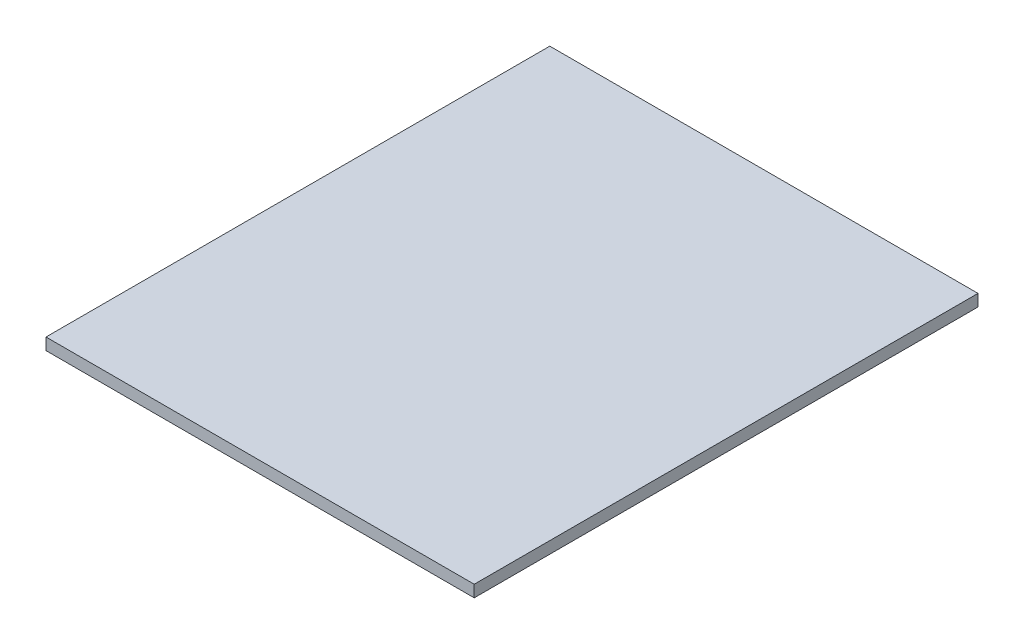
ISO-10303-21;
HEADER;
FILE_DESCRIPTION(('STEP AP214'),'2;1');
FILE_NAME('part.step','',(''),(''),'','','');
FILE_SCHEMA(('AUTOMOTIVE_DESIGN { 1 0 10303 214 1 1 1 1 }'));
ENDSEC;
DATA;
#1=APPLICATION_CONTEXT('core data for automotive mechanical design processes');
#2=APPLICATION_PROTOCOL_DEFINITION('international standard','automotive_design',2000,#1);
#3=PRODUCT_CONTEXT('',#1,'mechanical');
#4=PRODUCT('Part','Part','',(#3));
#5=PRODUCT_RELATED_PRODUCT_CATEGORY('part','',(#4));
#6=PRODUCT_DEFINITION_FORMATION('','',#4);
#7=PRODUCT_DEFINITION_CONTEXT('part definition',#1,'design');
#8=PRODUCT_DEFINITION('design','',#6,#7);
#9=PRODUCT_DEFINITION_SHAPE('','',#8);
#10=(LENGTH_UNIT() NAMED_UNIT(*) SI_UNIT(.MILLI.,.METRE.));
#11=(NAMED_UNIT(*) PLANE_ANGLE_UNIT() SI_UNIT($,.RADIAN.));
#12=(NAMED_UNIT(*) SI_UNIT($,.STERADIAN.) SOLID_ANGLE_UNIT());
#13=UNCERTAINTY_MEASURE_WITH_UNIT(LENGTH_MEASURE(1.E-05),#10,'distance_accuracy_value','');
#14=(GEOMETRIC_REPRESENTATION_CONTEXT(3) GLOBAL_UNCERTAINTY_ASSIGNED_CONTEXT((#13)) GLOBAL_UNIT_ASSIGNED_CONTEXT((#10,
#11,#12)) REPRESENTATION_CONTEXT('',''));
#15=CARTESIAN_POINT('',(0.,0.,0.));
#16=DIRECTION('',(0.,0.,1.));
#17=DIRECTION('',(1.,0.,0.));
#18=AXIS2_PLACEMENT_3D('',#15,#16,#17);
#19=CARTESIAN_POINT('',(215.9,11.90625,254.));
#20=DIRECTION('',(-1.,0.,0.));
#21=DIRECTION('',(0.,0.,1.));
#22=AXIS2_PLACEMENT_3D('',#19,#20,#21);
#23=PLANE('',#22);
#24=DIRECTION('',(0.,0.,-1.));
#25=VECTOR('',#24,1.);
#26=CARTESIAN_POINT('',(215.9,0.,254.));
#27=LINE('',#26,#25);
#28=CARTESIAN_POINT('',(215.9,0.,254.));
#29=VERTEX_POINT('',#28);
#30=CARTESIAN_POINT('',(215.9,0.,-254.));
#31=VERTEX_POINT('',#30);
#32=EDGE_CURVE('E96',#29,#31,#27,.T.);
#33=ORIENTED_EDGE('',*,*,#32,.T.);
#34=DIRECTION('',(0.,-1.,0.));
#35=VECTOR('',#34,1.);
#36=CARTESIAN_POINT('',(215.9,11.90625,-254.));
#37=LINE('',#36,#35);
#38=CARTESIAN_POINT('',(215.9,11.90625,-254.));
#39=VERTEX_POINT('',#38);
#40=EDGE_CURVE('E11',#39,#31,#37,.T.);
#41=ORIENTED_EDGE('',*,*,#40,.F.);
#42=DIRECTION('',(0.,0.,-1.));
#43=VECTOR('',#42,1.);
#44=CARTESIAN_POINT('',(215.9,11.90625,254.));
#45=LINE('',#44,#43);
#46=CARTESIAN_POINT('',(215.9,11.90625,254.));
#47=VERTEX_POINT('',#46);
#48=EDGE_CURVE('E84',#47,#39,#45,.T.);
#49=ORIENTED_EDGE('',*,*,#48,.F.);
#50=DIRECTION('',(0.,-1.,0.));
#51=VECTOR('',#50,1.);
#52=CARTESIAN_POINT('',(215.9,11.90625,254.));
#53=LINE('',#52,#51);
#54=EDGE_CURVE('E92',#47,#29,#53,.T.);
#55=ORIENTED_EDGE('',*,*,#54,.T.);
#56=EDGE_LOOP('',(#33,#41,#49,#55));
#57=FACE_BOUND('',#56,.T.);
#58=ADVANCED_FACE('F33',(#57),#23,.F.);
#59=CARTESIAN_POINT('',(-215.9,11.90625,-254.));
#60=DIRECTION('',(0.,0.,1.));
#61=DIRECTION('',(1.,0.,0.));
#62=AXIS2_PLACEMENT_3D('',#59,#60,#61);
#63=PLANE('',#62);
#64=DIRECTION('',(-1.,0.,0.));
#65=VECTOR('',#64,1.);
#66=CARTESIAN_POINT('',(-215.9,0.,-254.));
#67=LINE('',#66,#65);
#68=CARTESIAN_POINT('',(-215.9,0.,-254.));
#69=VERTEX_POINT('',#68);
#70=EDGE_CURVE('E88',#31,#69,#67,.T.);
#71=ORIENTED_EDGE('',*,*,#70,.T.);
#72=DIRECTION('',(0.,-1.,0.));
#73=VECTOR('',#72,1.);
#74=CARTESIAN_POINT('',(-215.9,11.90625,-254.));
#75=LINE('',#74,#73);
#76=CARTESIAN_POINT('',(-215.9,11.90625,-254.));
#77=VERTEX_POINT('',#76);
#78=EDGE_CURVE('E41',#77,#69,#75,.T.);
#79=ORIENTED_EDGE('',*,*,#78,.F.);
#80=DIRECTION('',(-1.,0.,0.));
#81=VECTOR('',#80,1.);
#82=CARTESIAN_POINT('',(-215.9,11.90625,-254.));
#83=LINE('',#82,#81);
#84=EDGE_CURVE('E79',#39,#77,#83,.T.);
#85=ORIENTED_EDGE('',*,*,#84,.F.);
#86=ORIENTED_EDGE('',*,*,#40,.T.);
#87=EDGE_LOOP('',(#71,#79,#85,#86));
#88=FACE_BOUND('',#87,.T.);
#89=ADVANCED_FACE('F87',(#88),#63,.F.);
#90=CARTESIAN_POINT('',(-215.9,11.90625,254.));
#91=DIRECTION('',(1.,0.,0.));
#92=DIRECTION('',(0.,0.,-1.));
#93=AXIS2_PLACEMENT_3D('',#90,#91,#92);
#94=PLANE('',#93);
#95=DIRECTION('',(0.,0.,1.));
#96=VECTOR('',#95,1.);
#97=CARTESIAN_POINT('',(-215.9,0.,254.));
#98=LINE('',#97,#96);
#99=CARTESIAN_POINT('',(-215.9,0.,254.));
#100=VERTEX_POINT('',#99);
#101=EDGE_CURVE('E66',#69,#100,#98,.T.);
#102=ORIENTED_EDGE('',*,*,#101,.T.);
#103=DIRECTION('',(0.,-1.,0.));
#104=VECTOR('',#103,1.);
#105=CARTESIAN_POINT('',(-215.9,11.90625,254.));
#106=LINE('',#105,#104);
#107=CARTESIAN_POINT('',(-215.9,11.90625,254.));
#108=VERTEX_POINT('',#107);
#109=EDGE_CURVE('E89',#108,#100,#106,.T.);
#110=ORIENTED_EDGE('',*,*,#109,.F.);
#111=DIRECTION('',(0.,0.,1.));
#112=VECTOR('',#111,1.);
#113=CARTESIAN_POINT('',(-215.9,11.90625,254.));
#114=LINE('',#113,#112);
#115=EDGE_CURVE('E82',#77,#108,#114,.T.);
#116=ORIENTED_EDGE('',*,*,#115,.F.);
#117=ORIENTED_EDGE('',*,*,#78,.T.);
#118=EDGE_LOOP('',(#102,#110,#116,#117));
#119=FACE_BOUND('',#118,.T.);
#120=ADVANCED_FACE('F90',(#119),#94,.F.);
#121=CARTESIAN_POINT('',(-215.9,11.90625,254.));
#122=DIRECTION('',(0.,0.,-1.));
#123=DIRECTION('',(-1.,0.,0.));
#124=AXIS2_PLACEMENT_3D('',#121,#122,#123);
#125=PLANE('',#124);
#126=DIRECTION('',(1.,0.,0.));
#127=VECTOR('',#126,1.);
#128=CARTESIAN_POINT('',(-215.9,0.,254.));
#129=LINE('',#128,#127);
#130=EDGE_CURVE('E72',#100,#29,#129,.T.);
#131=ORIENTED_EDGE('',*,*,#130,.T.);
#132=ORIENTED_EDGE('',*,*,#54,.F.);
#133=DIRECTION('',(1.,0.,0.));
#134=VECTOR('',#133,1.);
#135=CARTESIAN_POINT('',(-215.9,11.90625,254.));
#136=LINE('',#135,#134);
#137=EDGE_CURVE('E49',#108,#47,#136,.T.);
#138=ORIENTED_EDGE('',*,*,#137,.F.);
#139=ORIENTED_EDGE('',*,*,#109,.T.);
#140=EDGE_LOOP('',(#131,#132,#138,#139));
#141=FACE_BOUND('',#140,.T.);
#142=ADVANCED_FACE('F103',(#141),#125,.F.);
#143=CARTESIAN_POINT('',(0.,11.90625,0.));
#144=DIRECTION('',(0.,-1.,0.));
#145=DIRECTION('',(0.,0.,-1.));
#146=AXIS2_PLACEMENT_3D('',#143,#144,#145);
#147=PLANE('',#146);
#148=ORIENTED_EDGE('',*,*,#48,.T.);
#149=ORIENTED_EDGE('',*,*,#84,.T.);
#150=ORIENTED_EDGE('',*,*,#115,.T.);
#151=ORIENTED_EDGE('',*,*,#137,.T.);
#152=EDGE_LOOP('',(#148,#149,#150,#151));
#153=FACE_BOUND('',#152,.T.);
#154=ADVANCED_FACE('F80',(#153),#147,.F.);
#155=CARTESIAN_POINT('',(0.,0.,0.));
#156=DIRECTION('',(0.,-1.,0.));
#157=DIRECTION('',(0.,0.,-1.));
#158=AXIS2_PLACEMENT_3D('',#155,#156,#157);
#159=PLANE('',#158);
#160=ORIENTED_EDGE('',*,*,#32,.F.);
#161=ORIENTED_EDGE('',*,*,#130,.F.);
#162=ORIENTED_EDGE('',*,*,#101,.F.);
#163=ORIENTED_EDGE('',*,*,#70,.F.);
#164=EDGE_LOOP('',(#160,#161,#162,#163));
#165=FACE_BOUND('',#164,.T.);
#166=ADVANCED_FACE('F106',(#165),#159,.T.);
#167=CLOSED_SHELL('',(#58,#89,#120,#142,#154,#166));
#168=MANIFOLD_SOLID_BREP('B2',#167);
#169=ADVANCED_BREP_SHAPE_REPRESENTATION('',(#18,#168),#14);
#170=SHAPE_DEFINITION_REPRESENTATION(#9,#169);
ENDSEC;
END-ISO-10303-21;
